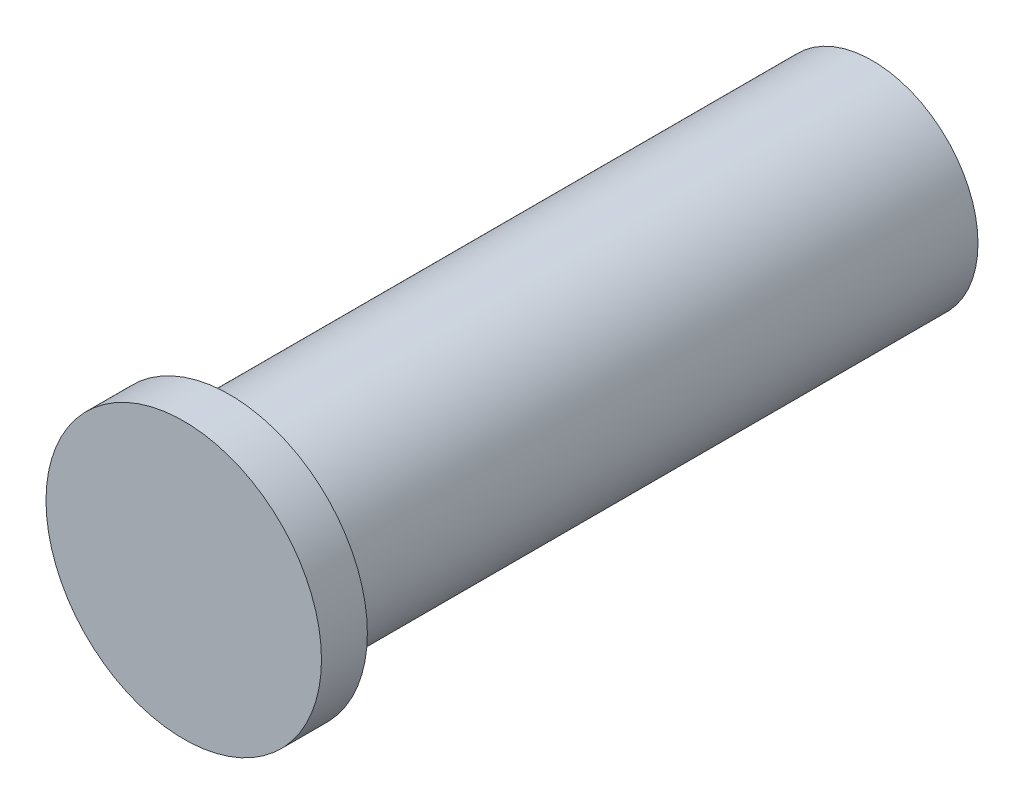
ISO-10303-21;
HEADER;
FILE_DESCRIPTION(('STEP AP214'),'2;1');
FILE_NAME('part.step','',(''),(''),'','','');
FILE_SCHEMA(('AUTOMOTIVE_DESIGN { 1 0 10303 214 1 1 1 1 }'));
ENDSEC;
DATA;
#1=APPLICATION_CONTEXT('core data for automotive mechanical design processes');
#2=APPLICATION_PROTOCOL_DEFINITION('international standard','automotive_design',2000,#1);
#3=PRODUCT_CONTEXT('',#1,'mechanical');
#4=PRODUCT('Part','Part','',(#3));
#5=PRODUCT_RELATED_PRODUCT_CATEGORY('part','',(#4));
#6=PRODUCT_DEFINITION_FORMATION('','',#4);
#7=PRODUCT_DEFINITION_CONTEXT('part definition',#1,'design');
#8=PRODUCT_DEFINITION('design','',#6,#7);
#9=PRODUCT_DEFINITION_SHAPE('','',#8);
#10=(LENGTH_UNIT() NAMED_UNIT(*) SI_UNIT(.MILLI.,.METRE.));
#11=(NAMED_UNIT(*) PLANE_ANGLE_UNIT() SI_UNIT($,.RADIAN.));
#12=(NAMED_UNIT(*) SI_UNIT($,.STERADIAN.) SOLID_ANGLE_UNIT());
#13=UNCERTAINTY_MEASURE_WITH_UNIT(LENGTH_MEASURE(1.E-05),#10,'distance_accuracy_value','');
#14=(GEOMETRIC_REPRESENTATION_CONTEXT(3) GLOBAL_UNCERTAINTY_ASSIGNED_CONTEXT((#13)) GLOBAL_UNIT_ASSIGNED_CONTEXT((#10,
#11,#12)) REPRESENTATION_CONTEXT('',''));
#15=CARTESIAN_POINT('',(0.,0.,0.));
#16=DIRECTION('',(0.,0.,1.));
#17=DIRECTION('',(1.,0.,0.));
#18=AXIS2_PLACEMENT_3D('',#15,#16,#17);
#19=CARTESIAN_POINT('',(0.,0.,14.));
#20=DIRECTION('',(0.,0.,-1.));
#21=DIRECTION('',(-1.,0.,0.));
#22=AXIS2_PLACEMENT_3D('',#19,#20,#21);
#23=CYLINDRICAL_SURFACE('',#22,2.3);
#24=CARTESIAN_POINT('',(0.,0.,14.));
#25=DIRECTION('',(0.,0.,1.));
#26=DIRECTION('',(1.,0.,0.));
#27=AXIS2_PLACEMENT_3D('',#24,#25,#26);
#28=CIRCLE('',#27,2.3);
#29=CARTESIAN_POINT('',(2.3,0.,14.));
#30=VERTEX_POINT('',#29);
#31=EDGE_CURVE('E10',#30,#30,#28,.T.);
#32=ORIENTED_EDGE('',*,*,#31,.F.);
#33=EDGE_LOOP('',(#32));
#34=FACE_BOUND('',#33,.T.);
#35=CARTESIAN_POINT('',(0.,0.,0.));
#36=DIRECTION('',(0.,0.,1.));
#37=DIRECTION('',(1.,0.,0.));
#38=AXIS2_PLACEMENT_3D('',#35,#36,#37);
#39=CIRCLE('',#38,2.3);
#40=CARTESIAN_POINT('',(2.3,0.,0.));
#41=VERTEX_POINT('',#40);
#42=EDGE_CURVE('E34',#41,#41,#39,.T.);
#43=ORIENTED_EDGE('',*,*,#42,.T.);
#44=EDGE_LOOP('',(#43));
#45=FACE_BOUND('',#44,.T.);
#46=ADVANCED_FACE('F31',(#34,#45),#23,.T.);
#47=CARTESIAN_POINT('',(0.,0.,0.));
#48=DIRECTION('',(0.,0.,1.));
#49=DIRECTION('',(1.,0.,0.));
#50=AXIS2_PLACEMENT_3D('',#47,#48,#49);
#51=PLANE('',#50);
#52=ORIENTED_EDGE('',*,*,#42,.F.);
#53=EDGE_LOOP('',(#52));
#54=FACE_BOUND('',#53,.T.);
#55=ADVANCED_FACE('F54',(#54),#51,.F.);
#56=CARTESIAN_POINT('',(0.,0.,15.));
#57=DIRECTION('',(0.,0.,-1.));
#58=DIRECTION('',(-1.,0.,0.));
#59=AXIS2_PLACEMENT_3D('',#56,#57,#58);
#60=CYLINDRICAL_SURFACE('',#59,3.);
#61=CARTESIAN_POINT('',(0.,0.,15.));
#62=DIRECTION('',(0.,0.,1.));
#63=DIRECTION('',(1.,0.,0.));
#64=AXIS2_PLACEMENT_3D('',#61,#62,#63);
#65=CIRCLE('',#64,3.);
#66=CARTESIAN_POINT('',(3.,0.,15.));
#67=VERTEX_POINT('',#66);
#68=EDGE_CURVE('E41',#67,#67,#65,.T.);
#69=ORIENTED_EDGE('',*,*,#68,.F.);
#70=EDGE_LOOP('',(#69));
#71=FACE_BOUND('',#70,.T.);
#72=CARTESIAN_POINT('',(0.,0.,14.));
#73=DIRECTION('',(0.,0.,1.));
#74=DIRECTION('',(1.,0.,0.));
#75=AXIS2_PLACEMENT_3D('',#72,#73,#74);
#76=CIRCLE('',#75,3.);
#77=CARTESIAN_POINT('',(3.,0.,14.));
#78=VERTEX_POINT('',#77);
#79=EDGE_CURVE('E43',#78,#78,#76,.T.);
#80=ORIENTED_EDGE('',*,*,#79,.T.);
#81=EDGE_LOOP('',(#80));
#82=FACE_BOUND('',#81,.T.);
#83=ADVANCED_FACE('F51',(#71,#82),#60,.T.);
#84=CARTESIAN_POINT('',(0.,0.,15.));
#85=DIRECTION('',(0.,0.,1.));
#86=DIRECTION('',(1.,0.,0.));
#87=AXIS2_PLACEMENT_3D('',#84,#85,#86);
#88=PLANE('',#87);
#89=ORIENTED_EDGE('',*,*,#68,.T.);
#90=EDGE_LOOP('',(#89));
#91=FACE_BOUND('',#90,.T.);
#92=ADVANCED_FACE('F49',(#91),#88,.T.);
#93=CARTESIAN_POINT('',(0.,0.,14.));
#94=DIRECTION('',(0.,0.,1.));
#95=DIRECTION('',(1.,0.,0.));
#96=AXIS2_PLACEMENT_3D('',#93,#94,#95);
#97=PLANE('',#96);
#98=ORIENTED_EDGE('',*,*,#31,.T.);
#99=EDGE_LOOP('',(#98));
#100=FACE_BOUND('',#99,.T.);
#101=ORIENTED_EDGE('',*,*,#79,.F.);
#102=EDGE_LOOP('',(#101));
#103=FACE_BOUND('',#102,.T.);
#104=ADVANCED_FACE('F58',(#100,#103),#97,.F.);
#105=CLOSED_SHELL('',(#46,#55,#83,#92,#104));
#106=MANIFOLD_SOLID_BREP('B2',#105);
#107=ADVANCED_BREP_SHAPE_REPRESENTATION('',(#18,#106),#14);
#108=SHAPE_DEFINITION_REPRESENTATION(#9,#107);
ENDSEC;
END-ISO-10303-21;
